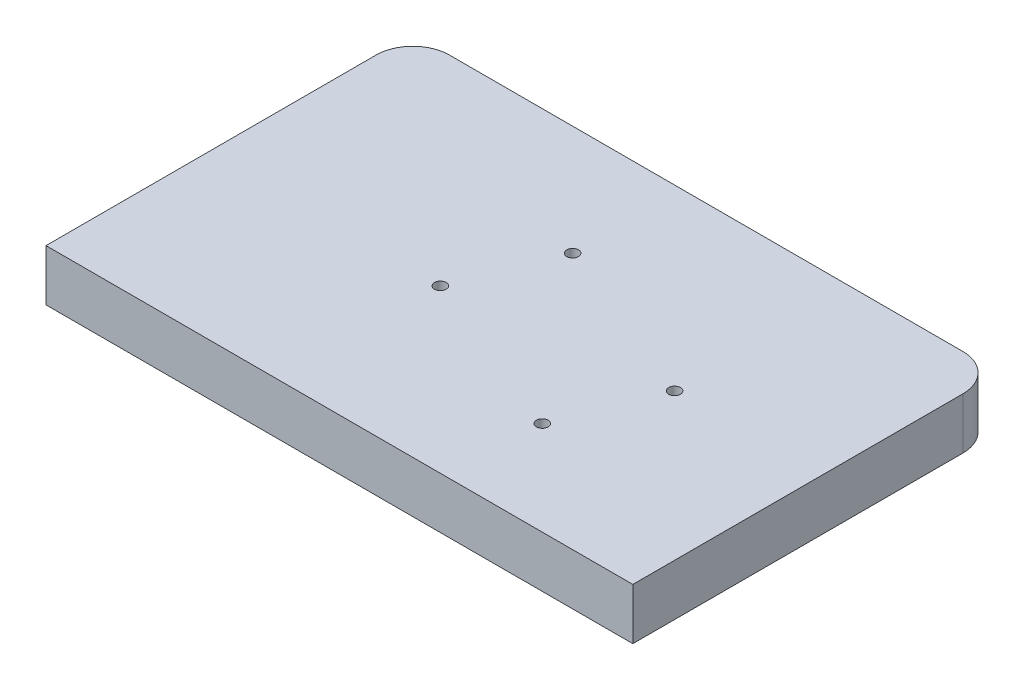
ISO-10303-21;
HEADER;
FILE_DESCRIPTION(('STEP AP214'),'2;1');
FILE_NAME('part.step','',(''),(''),'','','');
FILE_SCHEMA(('AUTOMOTIVE_DESIGN { 1 0 10303 214 1 1 1 1 }'));
ENDSEC;
DATA;
#1=APPLICATION_CONTEXT('core data for automotive mechanical design processes');
#2=APPLICATION_PROTOCOL_DEFINITION('international standard','automotive_design',2000,#1);
#3=PRODUCT_CONTEXT('',#1,'mechanical');
#4=PRODUCT('Part','Part','',(#3));
#5=PRODUCT_RELATED_PRODUCT_CATEGORY('part','',(#4));
#6=PRODUCT_DEFINITION_FORMATION('','',#4);
#7=PRODUCT_DEFINITION_CONTEXT('part definition',#1,'design');
#8=PRODUCT_DEFINITION('design','',#6,#7);
#9=PRODUCT_DEFINITION_SHAPE('','',#8);
#10=(LENGTH_UNIT() NAMED_UNIT(*) SI_UNIT(.MILLI.,.METRE.));
#11=(NAMED_UNIT(*) PLANE_ANGLE_UNIT() SI_UNIT($,.RADIAN.));
#12=(NAMED_UNIT(*) SI_UNIT($,.STERADIAN.) SOLID_ANGLE_UNIT());
#13=UNCERTAINTY_MEASURE_WITH_UNIT(LENGTH_MEASURE(1.E-05),#10,'distance_accuracy_value','');
#14=(GEOMETRIC_REPRESENTATION_CONTEXT(3) GLOBAL_UNCERTAINTY_ASSIGNED_CONTEXT((#13)) GLOBAL_UNIT_ASSIGNED_CONTEXT((#10,
#11,#12)) REPRESENTATION_CONTEXT('',''));
#15=CARTESIAN_POINT('',(0.,0.,0.));
#16=DIRECTION('',(0.,0.,1.));
#17=DIRECTION('',(1.,0.,0.));
#18=AXIS2_PLACEMENT_3D('',#15,#16,#17);
#19=CARTESIAN_POINT('',(101.6,17.78,-63.5));
#20=DIRECTION('',(-1.,0.,0.));
#21=DIRECTION('',(0.,0.,1.));
#22=AXIS2_PLACEMENT_3D('',#19,#20,#21);
#23=PLANE('',#22);
#24=DIRECTION('',(0.,0.,-1.));
#25=VECTOR('',#24,1.);
#26=CARTESIAN_POINT('',(101.6,0.,-63.5));
#27=LINE('',#26,#25);
#28=CARTESIAN_POINT('',(101.6,0.,63.5));
#29=VERTEX_POINT('',#28);
#30=CARTESIAN_POINT('',(101.6,0.,-50.8));
#31=VERTEX_POINT('',#30);
#32=EDGE_CURVE('E140',#29,#31,#27,.T.);
#33=ORIENTED_EDGE('',*,*,#32,.T.);
#34=DIRECTION('',(0.,-1.,0.));
#35=VECTOR('',#34,1.);
#36=CARTESIAN_POINT('',(101.6,17.78,-50.8));
#37=LINE('',#36,#35);
#38=CARTESIAN_POINT('',(101.6,17.78,-50.8));
#39=VERTEX_POINT('',#38);
#40=EDGE_CURVE('E13',#31,#39,#37,.F.);
#41=ORIENTED_EDGE('',*,*,#40,.T.);
#42=DIRECTION('',(0.,0.,-1.));
#43=VECTOR('',#42,1.);
#44=CARTESIAN_POINT('',(101.6,17.78,-63.5));
#45=LINE('',#44,#43);
#46=CARTESIAN_POINT('',(101.6,17.78,63.5));
#47=VERTEX_POINT('',#46);
#48=EDGE_CURVE('E149',#47,#39,#45,.T.);
#49=ORIENTED_EDGE('',*,*,#48,.F.);
#50=DIRECTION('',(0.,-1.,0.));
#51=VECTOR('',#50,1.);
#52=CARTESIAN_POINT('',(101.6,17.78,63.5));
#53=LINE('',#52,#51);
#54=EDGE_CURVE('E132',#47,#29,#53,.T.);
#55=ORIENTED_EDGE('',*,*,#54,.T.);
#56=EDGE_LOOP('',(#33,#41,#49,#55));
#57=FACE_BOUND('',#56,.T.);
#58=ADVANCED_FACE('F54',(#57),#23,.F.);
#59=CARTESIAN_POINT('',(-101.6,17.78,-63.5));
#60=DIRECTION('',(0.,0.,1.));
#61=DIRECTION('',(1.,0.,0.));
#62=AXIS2_PLACEMENT_3D('',#59,#60,#61);
#63=PLANE('',#62);
#64=DIRECTION('',(-1.,0.,0.));
#65=VECTOR('',#64,1.);
#66=CARTESIAN_POINT('',(-101.6,0.,-63.5));
#67=LINE('',#66,#65);
#68=CARTESIAN_POINT('',(88.9,0.,-63.5));
#69=VERTEX_POINT('',#68);
#70=CARTESIAN_POINT('',(-88.9,0.,-63.5));
#71=VERTEX_POINT('',#70);
#72=EDGE_CURVE('E142',#69,#71,#67,.T.);
#73=ORIENTED_EDGE('',*,*,#72,.T.);
#74=DIRECTION('',(0.,-1.,0.));
#75=VECTOR('',#74,1.);
#76=CARTESIAN_POINT('',(-88.9,17.78,-63.5));
#77=LINE('',#76,#75);
#78=CARTESIAN_POINT('',(-88.9,17.78,-63.5));
#79=VERTEX_POINT('',#78);
#80=EDGE_CURVE('E78',#71,#79,#77,.F.);
#81=ORIENTED_EDGE('',*,*,#80,.T.);
#82=DIRECTION('',(-1.,0.,0.));
#83=VECTOR('',#82,1.);
#84=CARTESIAN_POINT('',(-101.6,17.78,-63.5));
#85=LINE('',#84,#83);
#86=CARTESIAN_POINT('',(88.9,17.78,-63.5));
#87=VERTEX_POINT('',#86);
#88=EDGE_CURVE('E122',#87,#79,#85,.T.);
#89=ORIENTED_EDGE('',*,*,#88,.F.);
#90=DIRECTION('',(0.,-1.,0.));
#91=VECTOR('',#90,1.);
#92=CARTESIAN_POINT('',(88.9,17.78,-63.5));
#93=LINE('',#92,#91);
#94=EDGE_CURVE('E156',#87,#69,#93,.T.);
#95=ORIENTED_EDGE('',*,*,#94,.T.);
#96=EDGE_LOOP('',(#73,#81,#89,#95));
#97=FACE_BOUND('',#96,.T.);
#98=ADVANCED_FACE('F167',(#97),#63,.F.);
#99=CARTESIAN_POINT('',(-101.6,17.78,-63.5));
#100=DIRECTION('',(1.,0.,0.));
#101=DIRECTION('',(0.,0.,-1.));
#102=AXIS2_PLACEMENT_3D('',#99,#100,#101);
#103=PLANE('',#102);
#104=DIRECTION('',(0.,0.,1.));
#105=VECTOR('',#104,1.);
#106=CARTESIAN_POINT('',(-101.6,17.78,-63.5));
#107=LINE('',#106,#105);
#108=CARTESIAN_POINT('',(-101.6,17.78,-50.8));
#109=VERTEX_POINT('',#108);
#110=CARTESIAN_POINT('',(-101.6,17.78,63.5));
#111=VERTEX_POINT('',#110);
#112=EDGE_CURVE('E111',#109,#111,#107,.T.);
#113=ORIENTED_EDGE('',*,*,#112,.F.);
#114=DIRECTION('',(0.,-1.,0.));
#115=VECTOR('',#114,1.);
#116=CARTESIAN_POINT('',(-101.6,17.78,-50.8));
#117=LINE('',#116,#115);
#118=CARTESIAN_POINT('',(-101.6,0.,-50.8));
#119=VERTEX_POINT('',#118);
#120=EDGE_CURVE('E131',#109,#119,#117,.T.);
#121=ORIENTED_EDGE('',*,*,#120,.T.);
#122=DIRECTION('',(0.,0.,1.));
#123=VECTOR('',#122,1.);
#124=CARTESIAN_POINT('',(-101.6,0.,-63.5));
#125=LINE('',#124,#123);
#126=CARTESIAN_POINT('',(-101.6,0.,63.5));
#127=VERTEX_POINT('',#126);
#128=EDGE_CURVE('E128',#119,#127,#125,.T.);
#129=ORIENTED_EDGE('',*,*,#128,.T.);
#130=DIRECTION('',(0.,-1.,0.));
#131=VECTOR('',#130,1.);
#132=CARTESIAN_POINT('',(-101.6,17.78,63.5));
#133=LINE('',#132,#131);
#134=EDGE_CURVE('E125',#111,#127,#133,.T.);
#135=ORIENTED_EDGE('',*,*,#134,.F.);
#136=EDGE_LOOP('',(#113,#121,#129,#135));
#137=FACE_BOUND('',#136,.T.);
#138=ADVANCED_FACE('F126',(#137),#103,.F.);
#139=CARTESIAN_POINT('',(-101.6,17.78,63.5));
#140=DIRECTION('',(0.,0.,-1.));
#141=DIRECTION('',(-1.,0.,0.));
#142=AXIS2_PLACEMENT_3D('',#139,#140,#141);
#143=PLANE('',#142);
#144=DIRECTION('',(1.,0.,0.));
#145=VECTOR('',#144,1.);
#146=CARTESIAN_POINT('',(-101.6,0.,63.5));
#147=LINE('',#146,#145);
#148=EDGE_CURVE('E148',#127,#29,#147,.T.);
#149=ORIENTED_EDGE('',*,*,#148,.T.);
#150=ORIENTED_EDGE('',*,*,#54,.F.);
#151=DIRECTION('',(1.,0.,0.));
#152=VECTOR('',#151,1.);
#153=CARTESIAN_POINT('',(-101.6,17.78,63.5));
#154=LINE('',#153,#152);
#155=EDGE_CURVE('E115',#111,#47,#154,.T.);
#156=ORIENTED_EDGE('',*,*,#155,.F.);
#157=ORIENTED_EDGE('',*,*,#134,.T.);
#158=EDGE_LOOP('',(#149,#150,#156,#157));
#159=FACE_BOUND('',#158,.T.);
#160=ADVANCED_FACE('F134',(#159),#143,.F.);
#161=CARTESIAN_POINT('',(0.,17.78,0.));
#162=DIRECTION('',(0.,1.,0.));
#163=DIRECTION('',(0.,0.,1.));
#164=AXIS2_PLACEMENT_3D('',#161,#162,#163);
#165=PLANE('',#164);
#166=CARTESIAN_POINT('',(-8.13412282016085,17.78,-25.4));
#167=DIRECTION('',(0.,1.,0.));
#168=DIRECTION('',(0.,0.,1.));
#169=AXIS2_PLACEMENT_3D('',#166,#167,#168);
#170=CIRCLE('',#169,2.032);
#171=CARTESIAN_POINT('',(-8.13412282016085,17.78,-23.368));
#172=VERTEX_POINT('',#171);
#173=EDGE_CURVE('E219',#172,#172,#170,.T.);
#174=ORIENTED_EDGE('',*,*,#173,.F.);
#175=EDGE_LOOP('',(#174));
#176=FACE_BOUND('',#175,.T.);
#177=CARTESIAN_POINT('',(-21.2515844324389,17.78,7.29665134062526));
#178=DIRECTION('',(0.,1.,0.));
#179=DIRECTION('',(0.,0.,1.));
#180=AXIS2_PLACEMENT_3D('',#177,#178,#179);
#181=CIRCLE('',#180,2.03200000000001);
#182=CARTESIAN_POINT('',(-21.2515844324389,17.78,9.32865134062527));
#183=VERTEX_POINT('',#182);
#184=EDGE_CURVE('E212',#183,#183,#181,.T.);
#185=ORIENTED_EDGE('',*,*,#184,.F.);
#186=EDGE_LOOP('',(#185));
#187=FACE_BOUND('',#186,.T.);
#188=CARTESIAN_POINT('',(37.682538387722,17.78,30.9402375199298));
#189=DIRECTION('',(0.,1.,0.));
#190=DIRECTION('',(0.,0.,1.));
#191=AXIS2_PLACEMENT_3D('',#188,#189,#190);
#192=CIRCLE('',#191,2.032);
#193=CARTESIAN_POINT('',(37.682538387722,17.78,32.9722375199298));
#194=VERTEX_POINT('',#193);
#195=EDGE_CURVE('E206',#194,#194,#192,.T.);
#196=ORIENTED_EDGE('',*,*,#195,.F.);
#197=EDGE_LOOP('',(#196));
#198=FACE_BOUND('',#197,.T.);
#199=CARTESIAN_POINT('',(50.8,17.78,-1.75641382069549));
#200=DIRECTION('',(0.,1.,0.));
#201=DIRECTION('',(0.,0.,1.));
#202=AXIS2_PLACEMENT_3D('',#199,#200,#201);
#203=CIRCLE('',#202,2.032);
#204=CARTESIAN_POINT('',(50.8,17.78,0.275586179304515));
#205=VERTEX_POINT('',#204);
#206=EDGE_CURVE('E200',#205,#205,#203,.T.);
#207=ORIENTED_EDGE('',*,*,#206,.F.);
#208=EDGE_LOOP('',(#207));
#209=FACE_BOUND('',#208,.T.);
#210=ORIENTED_EDGE('',*,*,#88,.T.);
#211=CARTESIAN_POINT('',(-88.9,17.78,-50.8));
#212=DIRECTION('',(0.,1.,0.));
#213=DIRECTION('',(0.,0.,1.));
#214=AXIS2_PLACEMENT_3D('',#211,#212,#213);
#215=CIRCLE('',#214,12.7);
#216=EDGE_CURVE('E63',#79,#109,#215,.T.);
#217=ORIENTED_EDGE('',*,*,#216,.T.);
#218=ORIENTED_EDGE('',*,*,#112,.T.);
#219=ORIENTED_EDGE('',*,*,#155,.T.);
#220=ORIENTED_EDGE('',*,*,#48,.T.);
#221=CARTESIAN_POINT('',(88.9,17.78,-50.8));
#222=DIRECTION('',(0.,1.,0.));
#223=DIRECTION('',(0.,0.,1.));
#224=AXIS2_PLACEMENT_3D('',#221,#222,#223);
#225=CIRCLE('',#224,12.7);
#226=EDGE_CURVE('E161',#39,#87,#225,.T.);
#227=ORIENTED_EDGE('',*,*,#226,.T.);
#228=EDGE_LOOP('',(#210,#217,#218,#219,#220,#227));
#229=FACE_BOUND('',#228,.T.);
#230=ADVANCED_FACE('F113',(#176,#187,#198,#209,#229),#165,.T.);
#231=CARTESIAN_POINT('',(0.,0.,0.));
#232=DIRECTION('',(0.,1.,0.));
#233=DIRECTION('',(0.,0.,1.));
#234=AXIS2_PLACEMENT_3D('',#231,#232,#233);
#235=PLANE('',#234);
#236=CARTESIAN_POINT('',(50.8,0.,49.8348));
#237=DIRECTION('',(0.,-1.,0.));
#238=DIRECTION('',(0.,0.,-1.));
#239=AXIS2_PLACEMENT_3D('',#236,#237,#238);
#240=CIRCLE('',#239,2.0828);
#241=CARTESIAN_POINT('',(50.8,0.,47.752));
#242=VERTEX_POINT('',#241);
#243=EDGE_CURVE('E195',#242,#242,#240,.T.);
#244=ORIENTED_EDGE('',*,*,#243,.F.);
#245=EDGE_LOOP('',(#244));
#246=FACE_BOUND('',#245,.T.);
#247=CARTESIAN_POINT('',(33.5788,0.,25.0698));
#248=DIRECTION('',(0.,-1.,0.));
#249=DIRECTION('',(0.,0.,-1.));
#250=AXIS2_PLACEMENT_3D('',#247,#248,#249);
#251=CIRCLE('',#250,2.0828);
#252=CARTESIAN_POINT('',(33.5788,0.,22.987));
#253=VERTEX_POINT('',#252);
#254=EDGE_CURVE('E189',#253,#253,#251,.T.);
#255=ORIENTED_EDGE('',*,*,#254,.F.);
#256=EDGE_LOOP('',(#255));
#257=FACE_BOUND('',#256,.T.);
#258=CARTESIAN_POINT('',(-50.8,0.,25.0698));
#259=DIRECTION('',(0.,-1.,0.));
#260=DIRECTION('',(0.,0.,-1.));
#261=AXIS2_PLACEMENT_3D('',#258,#259,#260);
#262=CIRCLE('',#261,2.0828);
#263=CARTESIAN_POINT('',(-50.8,0.,22.987));
#264=VERTEX_POINT('',#263);
#265=EDGE_CURVE('E183',#264,#264,#262,.T.);
#266=ORIENTED_EDGE('',*,*,#265,.F.);
#267=EDGE_LOOP('',(#266));
#268=FACE_BOUND('',#267,.T.);
#269=CARTESIAN_POINT('',(-33.5788,0.,49.8348));
#270=DIRECTION('',(0.,-1.,0.));
#271=DIRECTION('',(0.,0.,-1.));
#272=AXIS2_PLACEMENT_3D('',#269,#270,#271);
#273=CIRCLE('',#272,2.0828);
#274=CARTESIAN_POINT('',(-33.5788,0.,47.752));
#275=VERTEX_POINT('',#274);
#276=EDGE_CURVE('E176',#275,#275,#273,.T.);
#277=ORIENTED_EDGE('',*,*,#276,.F.);
#278=EDGE_LOOP('',(#277));
#279=FACE_BOUND('',#278,.T.);
#280=ORIENTED_EDGE('',*,*,#128,.F.);
#281=CARTESIAN_POINT('',(-88.9,0.,-50.8));
#282=DIRECTION('',(0.,1.,0.));
#283=DIRECTION('',(0.,0.,1.));
#284=AXIS2_PLACEMENT_3D('',#281,#282,#283);
#285=CIRCLE('',#284,12.7);
#286=EDGE_CURVE('E154',#119,#71,#285,.F.);
#287=ORIENTED_EDGE('',*,*,#286,.T.);
#288=ORIENTED_EDGE('',*,*,#72,.F.);
#289=CARTESIAN_POINT('',(88.9,0.,-50.8));
#290=DIRECTION('',(0.,1.,0.));
#291=DIRECTION('',(0.,0.,1.));
#292=AXIS2_PLACEMENT_3D('',#289,#290,#291);
#293=CIRCLE('',#292,12.7);
#294=EDGE_CURVE('E152',#69,#31,#293,.F.);
#295=ORIENTED_EDGE('',*,*,#294,.T.);
#296=ORIENTED_EDGE('',*,*,#32,.F.);
#297=ORIENTED_EDGE('',*,*,#148,.F.);
#298=EDGE_LOOP('',(#280,#287,#288,#295,#296,#297));
#299=FACE_BOUND('',#298,.T.);
#300=ADVANCED_FACE('F172',(#246,#257,#268,#279,#299),#235,.F.);
#301=CARTESIAN_POINT('',(-88.9,17.78,-50.8));
#302=DIRECTION('',(0.,-1.,0.));
#303=DIRECTION('',(0.,0.,-1.));
#304=AXIS2_PLACEMENT_3D('',#301,#302,#303);
#305=CYLINDRICAL_SURFACE('',#304,12.7);
#306=ORIENTED_EDGE('',*,*,#216,.F.);
#307=ORIENTED_EDGE('',*,*,#80,.F.);
#308=ORIENTED_EDGE('',*,*,#286,.F.);
#309=ORIENTED_EDGE('',*,*,#120,.F.);
#310=EDGE_LOOP('',(#306,#307,#308,#309));
#311=FACE_BOUND('',#310,.T.);
#312=ADVANCED_FACE('F268',(#311),#305,.T.);
#313=CARTESIAN_POINT('',(88.9,17.78,-50.8));
#314=DIRECTION('',(0.,-1.,0.));
#315=DIRECTION('',(0.,0.,-1.));
#316=AXIS2_PLACEMENT_3D('',#313,#314,#315);
#317=CYLINDRICAL_SURFACE('',#316,12.7);
#318=ORIENTED_EDGE('',*,*,#226,.F.);
#319=ORIENTED_EDGE('',*,*,#40,.F.);
#320=ORIENTED_EDGE('',*,*,#294,.F.);
#321=ORIENTED_EDGE('',*,*,#94,.F.);
#322=EDGE_LOOP('',(#318,#319,#320,#321));
#323=FACE_BOUND('',#322,.T.);
#324=ADVANCED_FACE('F56',(#323),#317,.T.);
#325=CARTESIAN_POINT('',(-33.5788,12.7,49.8348));
#326=DIRECTION('',(0.,-1.,0.));
#327=DIRECTION('',(0.,0.,-1.));
#328=AXIS2_PLACEMENT_3D('',#325,#326,#327);
#329=CYLINDRICAL_SURFACE('',#328,2.0828);
#330=CARTESIAN_POINT('',(-33.5788,12.7,49.8348));
#331=DIRECTION('',(0.,-1.,0.));
#332=DIRECTION('',(0.,0.,-1.));
#333=AXIS2_PLACEMENT_3D('',#330,#331,#332);
#334=CIRCLE('',#333,2.0828);
#335=CARTESIAN_POINT('',(-33.5788,12.7,47.752));
#336=VERTEX_POINT('',#335);
#337=EDGE_CURVE('E179',#336,#336,#334,.T.);
#338=ORIENTED_EDGE('',*,*,#337,.F.);
#339=EDGE_LOOP('',(#338));
#340=FACE_BOUND('',#339,.T.);
#341=ORIENTED_EDGE('',*,*,#276,.T.);
#342=EDGE_LOOP('',(#341));
#343=FACE_BOUND('',#342,.T.);
#344=ADVANCED_FACE('F275',(#340,#343),#329,.F.);
#345=CARTESIAN_POINT('',(-33.5788,12.7,49.8348));
#346=DIRECTION('',(0.,-1.,0.));
#347=DIRECTION('',(0.,0.,-1.));
#348=AXIS2_PLACEMENT_3D('',#345,#346,#347);
#349=PLANE('',#348);
#350=ORIENTED_EDGE('',*,*,#337,.T.);
#351=EDGE_LOOP('',(#350));
#352=FACE_BOUND('',#351,.T.);
#353=ADVANCED_FACE('F325',(#352),#349,.T.);
#354=CARTESIAN_POINT('',(-50.8,12.7,25.0698));
#355=DIRECTION('',(0.,-1.,0.));
#356=DIRECTION('',(0.,0.,-1.));
#357=AXIS2_PLACEMENT_3D('',#354,#355,#356);
#358=CYLINDRICAL_SURFACE('',#357,2.0828);
#359=CARTESIAN_POINT('',(-50.8,12.7,25.0698));
#360=DIRECTION('',(0.,-1.,0.));
#361=DIRECTION('',(0.,0.,-1.));
#362=AXIS2_PLACEMENT_3D('',#359,#360,#361);
#363=CIRCLE('',#362,2.0828);
#364=CARTESIAN_POINT('',(-50.8,12.7,22.987));
#365=VERTEX_POINT('',#364);
#366=EDGE_CURVE('E186',#365,#365,#363,.T.);
#367=ORIENTED_EDGE('',*,*,#366,.F.);
#368=EDGE_LOOP('',(#367));
#369=FACE_BOUND('',#368,.T.);
#370=ORIENTED_EDGE('',*,*,#265,.T.);
#371=EDGE_LOOP('',(#370));
#372=FACE_BOUND('',#371,.T.);
#373=ADVANCED_FACE('F334',(#369,#372),#358,.F.);
#374=CARTESIAN_POINT('',(-50.8,12.7,25.0698));
#375=DIRECTION('',(0.,-1.,0.));
#376=DIRECTION('',(0.,0.,-1.));
#377=AXIS2_PLACEMENT_3D('',#374,#375,#376);
#378=PLANE('',#377);
#379=ORIENTED_EDGE('',*,*,#366,.T.);
#380=EDGE_LOOP('',(#379));
#381=FACE_BOUND('',#380,.T.);
#382=ADVANCED_FACE('F344',(#381),#378,.T.);
#383=CARTESIAN_POINT('',(33.5788,12.7,25.0698));
#384=DIRECTION('',(0.,-1.,0.));
#385=DIRECTION('',(0.,0.,-1.));
#386=AXIS2_PLACEMENT_3D('',#383,#384,#385);
#387=CYLINDRICAL_SURFACE('',#386,2.0828);
#388=CARTESIAN_POINT('',(33.5788,12.7,25.0698));
#389=DIRECTION('',(0.,-1.,0.));
#390=DIRECTION('',(0.,0.,-1.));
#391=AXIS2_PLACEMENT_3D('',#388,#389,#390);
#392=CIRCLE('',#391,2.0828);
#393=CARTESIAN_POINT('',(33.5788,12.7,22.987));
#394=VERTEX_POINT('',#393);
#395=EDGE_CURVE('E192',#394,#394,#392,.T.);
#396=ORIENTED_EDGE('',*,*,#395,.F.);
#397=EDGE_LOOP('',(#396));
#398=FACE_BOUND('',#397,.T.);
#399=ORIENTED_EDGE('',*,*,#254,.T.);
#400=EDGE_LOOP('',(#399));
#401=FACE_BOUND('',#400,.T.);
#402=ADVANCED_FACE('F354',(#398,#401),#387,.F.);
#403=CARTESIAN_POINT('',(33.5788,12.7,25.0698));
#404=DIRECTION('',(0.,-1.,0.));
#405=DIRECTION('',(0.,0.,-1.));
#406=AXIS2_PLACEMENT_3D('',#403,#404,#405);
#407=PLANE('',#406);
#408=ORIENTED_EDGE('',*,*,#395,.T.);
#409=EDGE_LOOP('',(#408));
#410=FACE_BOUND('',#409,.T.);
#411=ADVANCED_FACE('F364',(#410),#407,.T.);
#412=CARTESIAN_POINT('',(50.8,12.7,49.8348));
#413=DIRECTION('',(0.,-1.,0.));
#414=DIRECTION('',(0.,0.,-1.));
#415=AXIS2_PLACEMENT_3D('',#412,#413,#414);
#416=CYLINDRICAL_SURFACE('',#415,2.0828);
#417=CARTESIAN_POINT('',(50.8,12.7,49.8348));
#418=DIRECTION('',(0.,-1.,0.));
#419=DIRECTION('',(0.,0.,-1.));
#420=AXIS2_PLACEMENT_3D('',#417,#418,#419);
#421=CIRCLE('',#420,2.0828);
#422=CARTESIAN_POINT('',(50.8,12.7,47.752));
#423=VERTEX_POINT('',#422);
#424=EDGE_CURVE('E143',#423,#423,#421,.T.);
#425=ORIENTED_EDGE('',*,*,#424,.F.);
#426=EDGE_LOOP('',(#425));
#427=FACE_BOUND('',#426,.T.);
#428=ORIENTED_EDGE('',*,*,#243,.T.);
#429=EDGE_LOOP('',(#428));
#430=FACE_BOUND('',#429,.T.);
#431=ADVANCED_FACE('F256',(#427,#430),#416,.F.);
#432=CARTESIAN_POINT('',(50.8,12.7,49.8348));
#433=DIRECTION('',(0.,-1.,0.));
#434=DIRECTION('',(0.,0.,-1.));
#435=AXIS2_PLACEMENT_3D('',#432,#433,#434);
#436=PLANE('',#435);
#437=ORIENTED_EDGE('',*,*,#424,.T.);
#438=EDGE_LOOP('',(#437));
#439=FACE_BOUND('',#438,.T.);
#440=ADVANCED_FACE('F246',(#439),#436,.T.);
#441=CARTESIAN_POINT('',(50.8,5.08,-1.75641382069549));
#442=DIRECTION('',(0.,1.,0.));
#443=DIRECTION('',(0.,0.,1.));
#444=AXIS2_PLACEMENT_3D('',#441,#442,#443);
#445=CYLINDRICAL_SURFACE('',#444,2.032);
#446=CARTESIAN_POINT('',(50.8,5.08,-1.75641382069549));
#447=DIRECTION('',(0.,1.,0.));
#448=DIRECTION('',(0.,0.,1.));
#449=AXIS2_PLACEMENT_3D('',#446,#447,#448);
#450=CIRCLE('',#449,2.032);
#451=CARTESIAN_POINT('',(50.8,5.08,0.275586179304515));
#452=VERTEX_POINT('',#451);
#453=EDGE_CURVE('E203',#452,#452,#450,.T.);
#454=ORIENTED_EDGE('',*,*,#453,.F.);
#455=EDGE_LOOP('',(#454));
#456=FACE_BOUND('',#455,.T.);
#457=ORIENTED_EDGE('',*,*,#206,.T.);
#458=EDGE_LOOP('',(#457));
#459=FACE_BOUND('',#458,.T.);
#460=ADVANCED_FACE('F243',(#456,#459),#445,.F.);
#461=CARTESIAN_POINT('',(50.8,5.08,-1.75641382069549));
#462=DIRECTION('',(0.,1.,0.));
#463=DIRECTION('',(0.,0.,1.));
#464=AXIS2_PLACEMENT_3D('',#461,#462,#463);
#465=PLANE('',#464);
#466=ORIENTED_EDGE('',*,*,#453,.T.);
#467=EDGE_LOOP('',(#466));
#468=FACE_BOUND('',#467,.T.);
#469=ADVANCED_FACE('F245',(#468),#465,.T.);
#470=CARTESIAN_POINT('',(37.682538387722,5.08,30.9402375199298));
#471=DIRECTION('',(0.,1.,0.));
#472=DIRECTION('',(0.,0.,1.));
#473=AXIS2_PLACEMENT_3D('',#470,#471,#472);
#474=CYLINDRICAL_SURFACE('',#473,2.032);
#475=CARTESIAN_POINT('',(37.682538387722,5.08,30.9402375199298));
#476=DIRECTION('',(0.,1.,0.));
#477=DIRECTION('',(0.,0.,1.));
#478=AXIS2_PLACEMENT_3D('',#475,#476,#477);
#479=CIRCLE('',#478,2.032);
#480=CARTESIAN_POINT('',(37.682538387722,5.08,32.9722375199298));
#481=VERTEX_POINT('',#480);
#482=EDGE_CURVE('E209',#481,#481,#479,.T.);
#483=ORIENTED_EDGE('',*,*,#482,.F.);
#484=EDGE_LOOP('',(#483));
#485=FACE_BOUND('',#484,.T.);
#486=ORIENTED_EDGE('',*,*,#195,.T.);
#487=EDGE_LOOP('',(#486));
#488=FACE_BOUND('',#487,.T.);
#489=ADVANCED_FACE('F253',(#485,#488),#474,.F.);
#490=CARTESIAN_POINT('',(37.682538387722,5.08,30.9402375199298));
#491=DIRECTION('',(0.,1.,0.));
#492=DIRECTION('',(0.,0.,1.));
#493=AXIS2_PLACEMENT_3D('',#490,#491,#492);
#494=PLANE('',#493);
#495=ORIENTED_EDGE('',*,*,#482,.T.);
#496=EDGE_LOOP('',(#495));
#497=FACE_BOUND('',#496,.T.);
#498=ADVANCED_FACE('F411',(#497),#494,.T.);
#499=CARTESIAN_POINT('',(-21.2515844324389,5.08,7.29665134062526));
#500=DIRECTION('',(0.,1.,0.));
#501=DIRECTION('',(0.,0.,1.));
#502=AXIS2_PLACEMENT_3D('',#499,#500,#501);
#503=CYLINDRICAL_SURFACE('',#502,2.03200000000001);
#504=CARTESIAN_POINT('',(-21.2515844324389,5.08,7.29665134062526));
#505=DIRECTION('',(0.,1.,0.));
#506=DIRECTION('',(0.,0.,1.));
#507=AXIS2_PLACEMENT_3D('',#504,#505,#506);
#508=CIRCLE('',#507,2.03200000000001);
#509=CARTESIAN_POINT('',(-21.2515844324389,5.08,9.32865134062527));
#510=VERTEX_POINT('',#509);
#511=EDGE_CURVE('E215',#510,#510,#508,.T.);
#512=ORIENTED_EDGE('',*,*,#511,.F.);
#513=EDGE_LOOP('',(#512));
#514=FACE_BOUND('',#513,.T.);
#515=ORIENTED_EDGE('',*,*,#184,.T.);
#516=EDGE_LOOP('',(#515));
#517=FACE_BOUND('',#516,.T.);
#518=ADVANCED_FACE('F421',(#514,#517),#503,.F.);
#519=CARTESIAN_POINT('',(-21.2515844324389,5.08,7.29665134062526));
#520=DIRECTION('',(0.,1.,0.));
#521=DIRECTION('',(0.,0.,1.));
#522=AXIS2_PLACEMENT_3D('',#519,#520,#521);
#523=PLANE('',#522);
#524=ORIENTED_EDGE('',*,*,#511,.T.);
#525=EDGE_LOOP('',(#524));
#526=FACE_BOUND('',#525,.T.);
#527=ADVANCED_FACE('F230',(#526),#523,.T.);
#528=CARTESIAN_POINT('',(-8.13412282016085,5.08,-25.4));
#529=DIRECTION('',(0.,1.,0.));
#530=DIRECTION('',(0.,0.,1.));
#531=AXIS2_PLACEMENT_3D('',#528,#529,#530);
#532=CYLINDRICAL_SURFACE('',#531,2.032);
#533=CARTESIAN_POINT('',(-8.13412282016085,5.08,-25.4));
#534=DIRECTION('',(0.,1.,0.));
#535=DIRECTION('',(0.,0.,1.));
#536=AXIS2_PLACEMENT_3D('',#533,#534,#535);
#537=CIRCLE('',#536,2.032);
#538=CARTESIAN_POINT('',(-8.13412282016085,5.08,-23.368));
#539=VERTEX_POINT('',#538);
#540=EDGE_CURVE('E180',#539,#539,#537,.T.);
#541=ORIENTED_EDGE('',*,*,#540,.F.);
#542=EDGE_LOOP('',(#541));
#543=FACE_BOUND('',#542,.T.);
#544=ORIENTED_EDGE('',*,*,#173,.T.);
#545=EDGE_LOOP('',(#544));
#546=FACE_BOUND('',#545,.T.);
#547=ADVANCED_FACE('F227',(#543,#546),#532,.F.);
#548=CARTESIAN_POINT('',(-8.13412282016085,5.08,-25.4));
#549=DIRECTION('',(0.,1.,0.));
#550=DIRECTION('',(0.,0.,1.));
#551=AXIS2_PLACEMENT_3D('',#548,#549,#550);
#552=PLANE('',#551);
#553=ORIENTED_EDGE('',*,*,#540,.T.);
#554=EDGE_LOOP('',(#553));
#555=FACE_BOUND('',#554,.T.);
#556=ADVANCED_FACE('F225',(#555),#552,.T.);
#557=CLOSED_SHELL('',(#58,#98,#138,#160,#230,#300,#312,#324,#344,#353,#373,#382,#402,#411,#431,
#440,#460,#469,#489,#498,#518,#527,#547,#556));
#558=MANIFOLD_SOLID_BREP('B2',#557);
#559=ADVANCED_BREP_SHAPE_REPRESENTATION('',(#18,#558),#14);
#560=SHAPE_DEFINITION_REPRESENTATION(#9,#559);
ENDSEC;
END-ISO-10303-21;
